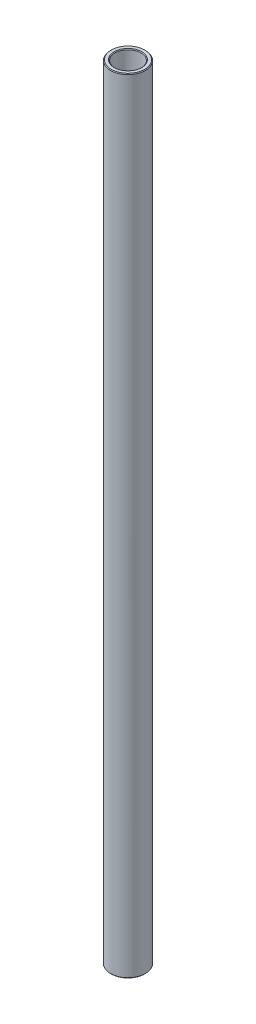
ISO-10303-21;
HEADER;
FILE_DESCRIPTION(('STEP AP214'),'2;1');
FILE_NAME('part.step','',(''),(''),'','','');
FILE_SCHEMA(('AUTOMOTIVE_DESIGN { 1 0 10303 214 1 1 1 1 }'));
ENDSEC;
DATA;
#1=APPLICATION_CONTEXT('core data for automotive mechanical design processes');
#2=APPLICATION_PROTOCOL_DEFINITION('international standard','automotive_design',2000,#1);
#3=PRODUCT_CONTEXT('',#1,'mechanical');
#4=PRODUCT('Part','Part','',(#3));
#5=PRODUCT_RELATED_PRODUCT_CATEGORY('part','',(#4));
#6=PRODUCT_DEFINITION_FORMATION('','',#4);
#7=PRODUCT_DEFINITION_CONTEXT('part definition',#1,'design');
#8=PRODUCT_DEFINITION('design','',#6,#7);
#9=PRODUCT_DEFINITION_SHAPE('','',#8);
#10=(LENGTH_UNIT() NAMED_UNIT(*) SI_UNIT(.MILLI.,.METRE.));
#11=(NAMED_UNIT(*) PLANE_ANGLE_UNIT() SI_UNIT($,.RADIAN.));
#12=(NAMED_UNIT(*) SI_UNIT($,.STERADIAN.) SOLID_ANGLE_UNIT());
#13=UNCERTAINTY_MEASURE_WITH_UNIT(LENGTH_MEASURE(1.E-05),#10,'distance_accuracy_value','');
#14=(GEOMETRIC_REPRESENTATION_CONTEXT(3) GLOBAL_UNCERTAINTY_ASSIGNED_CONTEXT((#13)) GLOBAL_UNIT_ASSIGNED_CONTEXT((#10,
#11,#12)) REPRESENTATION_CONTEXT('',''));
#15=CARTESIAN_POINT('',(0.,0.,0.));
#16=DIRECTION('',(0.,0.,1.));
#17=DIRECTION('',(1.,0.,0.));
#18=AXIS2_PLACEMENT_3D('',#15,#16,#17);
#19=CARTESIAN_POINT('',(0.,11.60859375,0.));
#20=DIRECTION('',(0.,1.,0.));
#21=DIRECTION('',(-1.,0.,0.));
#22=AXIS2_PLACEMENT_3D('',#19,#20,#21);
#23=CYLINDRICAL_SURFACE('',#22,4.7625);
#24=CARTESIAN_POINT('',(0.,-142.621,0.));
#25=DIRECTION('',(0.,1.,0.));
#26=DIRECTION('',(-1.,0.,0.));
#27=AXIS2_PLACEMENT_3D('',#24,#25,#26);
#28=CIRCLE('',#27,4.7625);
#29=CARTESIAN_POINT('',(-4.76250000000002,-142.621,0.));
#30=VERTEX_POINT('',#29);
#31=EDGE_CURVE('E51',#30,#30,#28,.F.);
#32=ORIENTED_EDGE('',*,*,#31,.T.);
#33=EDGE_LOOP('',(#32));
#34=FACE_BOUND('',#33,.T.);
#35=CARTESIAN_POINT('',(0.,142.621,0.));
#36=DIRECTION('',(0.,-1.,0.));
#37=DIRECTION('',(1.,0.,0.));
#38=AXIS2_PLACEMENT_3D('',#35,#36,#37);
#39=CIRCLE('',#38,4.7625);
#40=CARTESIAN_POINT('',(4.76250000000002,142.621,0.));
#41=VERTEX_POINT('',#40);
#42=EDGE_CURVE('E54',#41,#41,#39,.F.);
#43=ORIENTED_EDGE('',*,*,#42,.T.);
#44=EDGE_LOOP('',(#43));
#45=FACE_BOUND('',#44,.T.);
#46=ADVANCED_FACE('F31',(#34,#45),#23,.F.);
#47=CARTESIAN_POINT('',(4.76249999999999,142.875,0.));
#48=DIRECTION('',(0.,-1.,0.));
#49=DIRECTION('',(1.,0.,0.));
#50=AXIS2_PLACEMENT_3D('',#47,#48,#49);
#51=PLANE('',#50);
#52=CARTESIAN_POINT('',(0.,142.875,0.));
#53=DIRECTION('',(0.,-1.,0.));
#54=DIRECTION('',(1.,0.,0.));
#55=AXIS2_PLACEMENT_3D('',#52,#53,#54);
#56=CIRCLE('',#55,6.09599999999996);
#57=CARTESIAN_POINT('',(6.09599999999998,142.875,0.));
#58=VERTEX_POINT('',#57);
#59=EDGE_CURVE('E10',#58,#58,#56,.F.);
#60=ORIENTED_EDGE('',*,*,#59,.T.);
#61=EDGE_LOOP('',(#60));
#62=FACE_BOUND('',#61,.T.);
#63=CARTESIAN_POINT('',(0.,142.875,0.));
#64=DIRECTION('',(0.,-1.,0.));
#65=DIRECTION('',(1.,0.,0.));
#66=AXIS2_PLACEMENT_3D('',#63,#64,#65);
#67=CIRCLE('',#66,5.01650000000001);
#68=CARTESIAN_POINT('',(5.01650000000003,142.875,0.));
#69=VERTEX_POINT('',#68);
#70=EDGE_CURVE('E38',#69,#69,#67,.T.);
#71=ORIENTED_EDGE('',*,*,#70,.T.);
#72=EDGE_LOOP('',(#71));
#73=FACE_BOUND('',#72,.T.);
#74=ADVANCED_FACE('F77',(#62,#73),#51,.F.);
#75=CARTESIAN_POINT('',(0.,11.60859375,0.));
#76=DIRECTION('',(0.,1.,0.));
#77=DIRECTION('',(-1.,0.,0.));
#78=AXIS2_PLACEMENT_3D('',#75,#76,#77);
#79=CYLINDRICAL_SURFACE('',#78,6.35);
#80=CARTESIAN_POINT('',(0.,-142.621,0.));
#81=DIRECTION('',(0.,1.,0.));
#82=DIRECTION('',(-1.,0.,0.));
#83=AXIS2_PLACEMENT_3D('',#80,#81,#82);
#84=CIRCLE('',#83,6.35);
#85=CARTESIAN_POINT('',(-6.35000000000002,-142.621,0.));
#86=VERTEX_POINT('',#85);
#87=EDGE_CURVE('E42',#86,#86,#84,.T.);
#88=ORIENTED_EDGE('',*,*,#87,.T.);
#89=EDGE_LOOP('',(#88));
#90=FACE_BOUND('',#89,.T.);
#91=CARTESIAN_POINT('',(0.,142.621,0.));
#92=DIRECTION('',(0.,-1.,0.));
#93=DIRECTION('',(1.,0.,0.));
#94=AXIS2_PLACEMENT_3D('',#91,#92,#93);
#95=CIRCLE('',#94,6.35);
#96=CARTESIAN_POINT('',(6.35000000000002,142.621,0.));
#97=VERTEX_POINT('',#96);
#98=EDGE_CURVE('E46',#97,#97,#95,.T.);
#99=ORIENTED_EDGE('',*,*,#98,.T.);
#100=EDGE_LOOP('',(#99));
#101=FACE_BOUND('',#100,.T.);
#102=ADVANCED_FACE('F74',(#90,#101),#79,.T.);
#103=CARTESIAN_POINT('',(6.35000000000002,-142.875,0.));
#104=DIRECTION('',(0.,1.,0.));
#105=DIRECTION('',(-1.,0.,0.));
#106=AXIS2_PLACEMENT_3D('',#103,#104,#105);
#107=PLANE('',#106);
#108=CARTESIAN_POINT('',(0.,-142.875,0.));
#109=DIRECTION('',(0.,1.,0.));
#110=DIRECTION('',(-1.,0.,0.));
#111=AXIS2_PLACEMENT_3D('',#108,#109,#110);
#112=CIRCLE('',#111,5.01650000000006);
#113=CARTESIAN_POINT('',(-5.01650000000008,-142.875,0.));
#114=VERTEX_POINT('',#113);
#115=EDGE_CURVE('E57',#114,#114,#112,.T.);
#116=ORIENTED_EDGE('',*,*,#115,.T.);
#117=EDGE_LOOP('',(#116));
#118=FACE_BOUND('',#117,.T.);
#119=CARTESIAN_POINT('',(0.,-142.875,0.));
#120=DIRECTION('',(0.,1.,0.));
#121=DIRECTION('',(-1.,0.,0.));
#122=AXIS2_PLACEMENT_3D('',#119,#120,#121);
#123=CIRCLE('',#122,6.09599999999999);
#124=CARTESIAN_POINT('',(-6.09600000000001,-142.875,0.));
#125=VERTEX_POINT('',#124);
#126=EDGE_CURVE('E60',#125,#125,#123,.F.);
#127=ORIENTED_EDGE('',*,*,#126,.T.);
#128=EDGE_LOOP('',(#127));
#129=FACE_BOUND('',#128,.T.);
#130=ADVANCED_FACE('F64',(#118,#129),#107,.F.);
#131=CARTESIAN_POINT('',(0.,-142.875,0.));
#132=DIRECTION('',(0.,-1.,0.));
#133=DIRECTION('',(1.,0.,0.));
#134=AXIS2_PLACEMENT_3D('',#131,#132,#133);
#135=CONICAL_SURFACE('',#134,5.01650000000006,0.785398163397505);
#136=ORIENTED_EDGE('',*,*,#31,.F.);
#137=EDGE_LOOP('',(#136));
#138=FACE_BOUND('',#137,.T.);
#139=ORIENTED_EDGE('',*,*,#115,.F.);
#140=EDGE_LOOP('',(#139));
#141=FACE_BOUND('',#140,.T.);
#142=ADVANCED_FACE('F70',(#138,#141),#135,.F.);
#143=CARTESIAN_POINT('',(0.,-142.621,0.));
#144=DIRECTION('',(0.,1.,0.));
#145=DIRECTION('',(-1.,0.,0.));
#146=AXIS2_PLACEMENT_3D('',#143,#144,#145);
#147=CONICAL_SURFACE('',#146,6.35,0.78539816339752);
#148=ORIENTED_EDGE('',*,*,#126,.F.);
#149=EDGE_LOOP('',(#148));
#150=FACE_BOUND('',#149,.T.);
#151=ORIENTED_EDGE('',*,*,#87,.F.);
#152=EDGE_LOOP('',(#151));
#153=FACE_BOUND('',#152,.T.);
#154=ADVANCED_FACE('F66',(#150,#153),#147,.T.);
#155=CARTESIAN_POINT('',(0.,142.875,0.));
#156=DIRECTION('',(0.,-1.,0.));
#157=DIRECTION('',(1.,0.,0.));
#158=AXIS2_PLACEMENT_3D('',#155,#156,#157);
#159=CONICAL_SURFACE('',#158,6.09599999999996,0.785398163397465);
#160=ORIENTED_EDGE('',*,*,#98,.F.);
#161=EDGE_LOOP('',(#160));
#162=FACE_BOUND('',#161,.T.);
#163=ORIENTED_EDGE('',*,*,#59,.F.);
#164=EDGE_LOOP('',(#163));
#165=FACE_BOUND('',#164,.T.);
#166=ADVANCED_FACE('F69',(#162,#165),#159,.T.);
#167=CARTESIAN_POINT('',(0.,142.621,0.));
#168=DIRECTION('',(0.,1.,0.));
#169=DIRECTION('',(-1.,0.,0.));
#170=AXIS2_PLACEMENT_3D('',#167,#168,#169);
#171=CONICAL_SURFACE('',#170,4.7625,0.785398163397559);
#172=ORIENTED_EDGE('',*,*,#70,.F.);
#173=EDGE_LOOP('',(#172));
#174=FACE_BOUND('',#173,.T.);
#175=ORIENTED_EDGE('',*,*,#42,.F.);
#176=EDGE_LOOP('',(#175));
#177=FACE_BOUND('',#176,.T.);
#178=ADVANCED_FACE('F33',(#174,#177),#171,.F.);
#179=CLOSED_SHELL('',(#46,#74,#102,#130,#142,#154,#166,#178));
#180=MANIFOLD_SOLID_BREP('B2',#179);
#181=ADVANCED_BREP_SHAPE_REPRESENTATION('',(#18,#180),#14);
#182=SHAPE_DEFINITION_REPRESENTATION(#9,#181);
ENDSEC;
END-ISO-10303-21;
